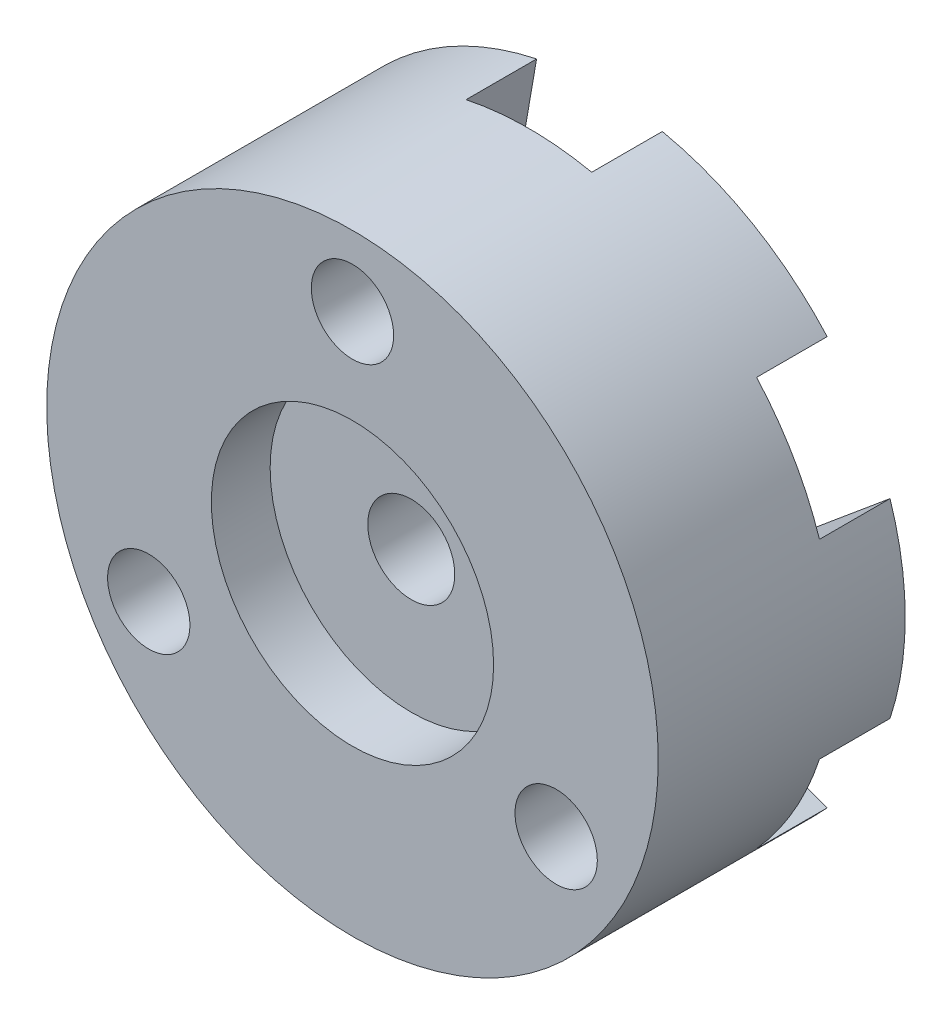
ISO-10303-21;
HEADER;
FILE_DESCRIPTION(('STEP AP214'),'2;1');
FILE_NAME('part.step','',(''),(''),'','','');
FILE_SCHEMA(('AUTOMOTIVE_DESIGN { 1 0 10303 214 1 1 1 1 }'));
ENDSEC;
DATA;
#1=APPLICATION_CONTEXT('core data for automotive mechanical design processes');
#2=APPLICATION_PROTOCOL_DEFINITION('international standard','automotive_design',2000,#1);
#3=PRODUCT_CONTEXT('',#1,'mechanical');
#4=PRODUCT('Part','Part','',(#3));
#5=PRODUCT_RELATED_PRODUCT_CATEGORY('part','',(#4));
#6=PRODUCT_DEFINITION_FORMATION('','',#4);
#7=PRODUCT_DEFINITION_CONTEXT('part definition',#1,'design');
#8=PRODUCT_DEFINITION('design','',#6,#7);
#9=PRODUCT_DEFINITION_SHAPE('','',#8);
#10=(LENGTH_UNIT() NAMED_UNIT(*) SI_UNIT(.MILLI.,.METRE.));
#11=(NAMED_UNIT(*) PLANE_ANGLE_UNIT() SI_UNIT($,.RADIAN.));
#12=(NAMED_UNIT(*) SI_UNIT($,.STERADIAN.) SOLID_ANGLE_UNIT());
#13=UNCERTAINTY_MEASURE_WITH_UNIT(LENGTH_MEASURE(1.E-05),#10,'distance_accuracy_value','');
#14=(GEOMETRIC_REPRESENTATION_CONTEXT(3) GLOBAL_UNCERTAINTY_ASSIGNED_CONTEXT((#13)) GLOBAL_UNIT_ASSIGNED_CONTEXT((#10,
#11,#12)) REPRESENTATION_CONTEXT('',''));
#15=CARTESIAN_POINT('',(0.,0.,0.));
#16=DIRECTION('',(0.,0.,1.));
#17=DIRECTION('',(1.,0.,0.));
#18=AXIS2_PLACEMENT_3D('',#15,#16,#17);
#19=CARTESIAN_POINT('',(0.,0.,0.));
#20=DIRECTION('',(0.,0.,1.));
#21=DIRECTION('',(1.,0.,0.));
#22=AXIS2_PLACEMENT_3D('',#19,#20,#21);
#23=CYLINDRICAL_SURFACE('',#22,6.);
#24=CARTESIAN_POINT('',(0.,0.,7.5));
#25=DIRECTION('',(0.,0.,1.));
#26=DIRECTION('',(1.,0.,0.));
#27=AXIS2_PLACEMENT_3D('',#24,#25,#26);
#28=CIRCLE('',#27,6.);
#29=CARTESIAN_POINT('',(6.,0.,7.5));
#30=VERTEX_POINT('',#29);
#31=EDGE_CURVE('E226',#30,#30,#28,.T.);
#32=ORIENTED_EDGE('',*,*,#31,.T.);
#33=EDGE_LOOP('',(#32));
#34=FACE_BOUND('',#33,.T.);
#35=CARTESIAN_POINT('',(0.,0.,5.));
#36=DIRECTION('',(0.,0.,-1.));
#37=DIRECTION('',(-1.,0.,0.));
#38=AXIS2_PLACEMENT_3D('',#35,#36,#37);
#39=CIRCLE('',#38,6.);
#40=CARTESIAN_POINT('',(-6.,0.,5.));
#41=VERTEX_POINT('',#40);
#42=EDGE_CURVE('E11',#41,#41,#39,.F.);
#43=ORIENTED_EDGE('',*,*,#42,.F.);
#44=EDGE_LOOP('',(#43));
#45=FACE_BOUND('',#44,.T.);
#46=ADVANCED_FACE('F33',(#34,#45),#23,.F.);
#47=CARTESIAN_POINT('',(0.,0.,-3.));
#48=DIRECTION('',(0.,0.,-1.));
#49=DIRECTION('',(-1.,0.,0.));
#50=AXIS2_PLACEMENT_3D('',#47,#48,#49);
#51=PLANE('',#50);
#52=DIRECTION('',(-0.170600768557539,0.985340234521851,0.));
#53=VECTOR('',#52,1.);
#54=CARTESIAN_POINT('',(3.75,6.49519052838327,-3.));
#55=LINE('',#54,#53);
#56=CARTESIAN_POINT('',(3.75,6.49519052838327,-3.));
#57=VERTEX_POINT('',#56);
#58=CARTESIAN_POINT('',(2.67181427614945,12.7224765071021,-3.));
#59=VERTEX_POINT('',#58);
#60=EDGE_CURVE('E668',#57,#59,#55,.T.);
#61=ORIENTED_EDGE('',*,*,#60,.T.);
#62=CARTESIAN_POINT('',(0.,0.,-3.));
#63=DIRECTION('',(0.,0.,-1.));
#64=DIRECTION('',(-1.,0.,0.));
#65=AXIS2_PLACEMENT_3D('',#62,#63,#64);
#66=CIRCLE('',#65,13.);
#67=CARTESIAN_POINT('',(9.68208071612639,8.67509729089038,-3.));
#68=VERTEX_POINT('',#67);
#69=EDGE_CURVE('E624',#59,#68,#66,.T.);
#70=ORIENTED_EDGE('',*,*,#69,.T.);
#71=DIRECTION('',(0.938630058745609,0.344925517784948,0.));
#72=VECTOR('',#71,1.);
#73=CARTESIAN_POINT('',(-1.65671533325682,4.50834377394232,-3.));
#74=LINE('',#73,#72);
#75=EDGE_CURVE('E41',#57,#68,#74,.T.);
#76=ORIENTED_EDGE('',*,*,#75,.F.);
#77=EDGE_LOOP('',(#61,#70,#76));
#78=FACE_BOUND('',#77,.T.);
#79=ADVANCED_FACE('F276',(#78),#51,.T.);
#80=DIRECTION('',(0.76802929018807,0.640414716736904,0.));
#81=VECTOR('',#80,1.);
#82=CARTESIAN_POINT('',(7.5,0.,-3.));
#83=LINE('',#82,#81);
#84=CARTESIAN_POINT('',(7.5,0.,-3.));
#85=VERTEX_POINT('',#84);
#86=CARTESIAN_POINT('',(12.3538949922758,4.04737921621166,-3.));
#87=VERTEX_POINT('',#86);
#88=EDGE_CURVE('E665',#85,#87,#83,.T.);
#89=ORIENTED_EDGE('',*,*,#88,.T.);
#90=CARTESIAN_POINT('',(12.3538949922758,-4.04737921621169,-3.));
#91=VERTEX_POINT('',#90);
#92=EDGE_CURVE('E619',#87,#91,#66,.T.);
#93=ORIENTED_EDGE('',*,*,#92,.T.);
#94=DIRECTION('',(0.768029290188071,-0.640414716736904,0.));
#95=VECTOR('',#94,1.);
#96=CARTESIAN_POINT('',(3.07598257059905,3.68892945241078,-3.));
#97=LINE('',#96,#95);
#98=EDGE_CURVE('E196',#85,#91,#97,.T.);
#99=ORIENTED_EDGE('',*,*,#98,.F.);
#100=EDGE_LOOP('',(#89,#93,#99));
#101=FACE_BOUND('',#100,.T.);
#102=ADVANCED_FACE('F282',(#101),#51,.T.);
#103=DIRECTION('',(0.938630058745609,-0.344925517784947,0.));
#104=VECTOR('',#103,1.);
#105=CARTESIAN_POINT('',(3.75,-6.49519052838331,-3.));
#106=LINE('',#105,#104);
#107=CARTESIAN_POINT('',(3.75,-6.49519052838331,-3.));
#108=VERTEX_POINT('',#107);
#109=CARTESIAN_POINT('',(9.68208071612636,-8.67509729089041,-3.));
#110=VERTEX_POINT('',#109);
#111=EDGE_CURVE('E608',#108,#110,#106,.T.);
#112=ORIENTED_EDGE('',*,*,#111,.T.);
#113=CARTESIAN_POINT('',(2.67181427614946,-12.7224765071021,-3.));
#114=VERTEX_POINT('',#113);
#115=EDGE_CURVE('E617',#110,#114,#66,.T.);
#116=ORIENTED_EDGE('',*,*,#115,.T.);
#117=DIRECTION('',(-0.170600768557539,-0.985340234521851,0.));
#118=VECTOR('',#117,1.);
#119=CARTESIAN_POINT('',(4.7326979038559,-0.819414321531559,-3.));
#120=LINE('',#119,#118);
#121=EDGE_CURVE('E189',#108,#114,#120,.T.);
#122=ORIENTED_EDGE('',*,*,#121,.F.);
#123=EDGE_LOOP('',(#112,#116,#122));
#124=FACE_BOUND('',#123,.T.);
#125=ADVANCED_FACE('F530',(#124),#51,.T.);
#126=DIRECTION('',(0.170600768557539,-0.985340234521851,0.));
#127=VECTOR('',#126,1.);
#128=CARTESIAN_POINT('',(-3.75,-6.49519052838332,-3.));
#129=LINE('',#128,#127);
#130=CARTESIAN_POINT('',(-3.75,-6.49519052838332,-3.));
#131=VERTEX_POINT('',#130);
#132=CARTESIAN_POINT('',(-2.67181427614946,-12.7224765071021,-3.));
#133=VERTEX_POINT('',#132);
#134=EDGE_CURVE('E182',#131,#133,#129,.T.);
#135=ORIENTED_EDGE('',*,*,#134,.T.);
#136=CARTESIAN_POINT('',(-9.68208071612636,-8.67509729089042,-3.));
#137=VERTEX_POINT('',#136);
#138=EDGE_CURVE('E224',#133,#137,#66,.T.);
#139=ORIENTED_EDGE('',*,*,#138,.T.);
#140=DIRECTION('',(-0.938630058745609,-0.344925517784948,0.));
#141=VECTOR('',#140,1.);
#142=CARTESIAN_POINT('',(1.65671533325684,-4.50834377394236,-3.));
#143=LINE('',#142,#141);
#144=EDGE_CURVE('E186',#131,#137,#143,.T.);
#145=ORIENTED_EDGE('',*,*,#144,.F.);
#146=EDGE_LOOP('',(#135,#139,#145));
#147=FACE_BOUND('',#146,.T.);
#148=ADVANCED_FACE('F272',(#147),#51,.T.);
#149=DIRECTION('',(-0.76802929018807,-0.640414716736904,0.));
#150=VECTOR('',#149,1.);
#151=CARTESIAN_POINT('',(-7.5,0.,-3.));
#152=LINE('',#151,#150);
#153=CARTESIAN_POINT('',(-7.5,0.,-3.));
#154=VERTEX_POINT('',#153);
#155=CARTESIAN_POINT('',(-12.3538949922758,-4.0473792162117,-3.));
#156=VERTEX_POINT('',#155);
#157=EDGE_CURVE('E175',#154,#156,#152,.T.);
#158=ORIENTED_EDGE('',*,*,#157,.T.);
#159=CARTESIAN_POINT('',(-12.3538949922758,4.04737921621165,-3.));
#160=VERTEX_POINT('',#159);
#161=EDGE_CURVE('E185',#156,#160,#66,.T.);
#162=ORIENTED_EDGE('',*,*,#161,.T.);
#163=DIRECTION('',(-0.768029290188071,0.640414716736903,0.));
#164=VECTOR('',#163,1.);
#165=CARTESIAN_POINT('',(-3.07598257059907,-3.6889294524108,-3.));
#166=LINE('',#165,#164);
#167=EDGE_CURVE('E164',#154,#160,#166,.T.);
#168=ORIENTED_EDGE('',*,*,#167,.F.);
#169=EDGE_LOOP('',(#158,#162,#168));
#170=FACE_BOUND('',#169,.T.);
#171=ADVANCED_FACE('F184',(#170),#51,.T.);
#172=CARTESIAN_POINT('',(-8.66025403784439,-5.,0.));
#173=DIRECTION('',(0.,0.,1.));
#174=DIRECTION('',(1.,0.,0.));
#175=AXIS2_PLACEMENT_3D('',#172,#173,#174);
#176=CYLINDRICAL_SURFACE('',#175,1.75);
#177=CARTESIAN_POINT('',(-8.66025403784439,-5.,7.5));
#178=DIRECTION('',(0.,0.,1.));
#179=DIRECTION('',(1.,0.,0.));
#180=AXIS2_PLACEMENT_3D('',#177,#178,#179);
#181=CIRCLE('',#180,1.75);
#182=CARTESIAN_POINT('',(-6.91025403784439,-5.,7.5));
#183=VERTEX_POINT('',#182);
#184=EDGE_CURVE('E245',#183,#183,#181,.T.);
#185=ORIENTED_EDGE('',*,*,#184,.T.);
#186=EDGE_LOOP('',(#185));
#187=FACE_BOUND('',#186,.T.);
#188=CARTESIAN_POINT('',(-8.66025403784439,-5.,2.6));
#189=DIRECTION('',(0.,0.,-1.));
#190=DIRECTION('',(-1.,0.,0.));
#191=AXIS2_PLACEMENT_3D('',#188,#189,#190);
#192=CIRCLE('',#191,1.75);
#193=CARTESIAN_POINT('',(-10.4102540378444,-5.,2.6));
#194=VERTEX_POINT('',#193);
#195=EDGE_CURVE('E248',#194,#194,#192,.F.);
#196=ORIENTED_EDGE('',*,*,#195,.F.);
#197=EDGE_LOOP('',(#196));
#198=FACE_BOUND('',#197,.T.);
#199=ADVANCED_FACE('F260',(#187,#198),#176,.F.);
#200=CARTESIAN_POINT('',(8.66025403784439,-5.,0.));
#201=DIRECTION('',(0.,0.,1.));
#202=DIRECTION('',(1.,0.,0.));
#203=AXIS2_PLACEMENT_3D('',#200,#201,#202);
#204=CYLINDRICAL_SURFACE('',#203,1.75);
#205=CARTESIAN_POINT('',(8.66025403784439,-5.,7.5));
#206=DIRECTION('',(0.,0.,1.));
#207=DIRECTION('',(1.,0.,0.));
#208=AXIS2_PLACEMENT_3D('',#205,#206,#207);
#209=CIRCLE('',#208,1.75);
#210=CARTESIAN_POINT('',(10.4102540378444,-5.,7.5));
#211=VERTEX_POINT('',#210);
#212=EDGE_CURVE('E242',#211,#211,#209,.T.);
#213=ORIENTED_EDGE('',*,*,#212,.T.);
#214=EDGE_LOOP('',(#213));
#215=FACE_BOUND('',#214,.T.);
#216=CARTESIAN_POINT('',(8.66025403784439,-5.,2.6));
#217=DIRECTION('',(0.,0.,-1.));
#218=DIRECTION('',(-1.,0.,0.));
#219=AXIS2_PLACEMENT_3D('',#216,#217,#218);
#220=CIRCLE('',#219,1.75);
#221=CARTESIAN_POINT('',(6.91025403784439,-5.,2.6));
#222=VERTEX_POINT('',#221);
#223=EDGE_CURVE('E253',#222,#222,#220,.F.);
#224=ORIENTED_EDGE('',*,*,#223,.F.);
#225=EDGE_LOOP('',(#224));
#226=FACE_BOUND('',#225,.T.);
#227=ADVANCED_FACE('F262',(#215,#226),#204,.F.);
#228=CARTESIAN_POINT('',(0.,10.,0.));
#229=DIRECTION('',(0.,0.,1.));
#230=DIRECTION('',(1.,0.,0.));
#231=AXIS2_PLACEMENT_3D('',#228,#229,#230);
#232=CYLINDRICAL_SURFACE('',#231,1.75);
#233=CARTESIAN_POINT('',(0.,10.,7.5));
#234=DIRECTION('',(0.,0.,1.));
#235=DIRECTION('',(1.,0.,0.));
#236=AXIS2_PLACEMENT_3D('',#233,#234,#235);
#237=CIRCLE('',#236,1.75);
#238=CARTESIAN_POINT('',(1.75,10.,7.5));
#239=VERTEX_POINT('',#238);
#240=EDGE_CURVE('E239',#239,#239,#237,.T.);
#241=ORIENTED_EDGE('',*,*,#240,.T.);
#242=EDGE_LOOP('',(#241));
#243=FACE_BOUND('',#242,.T.);
#244=CARTESIAN_POINT('',(0.,10.,2.6));
#245=DIRECTION('',(0.,0.,-1.));
#246=DIRECTION('',(-1.,0.,0.));
#247=AXIS2_PLACEMENT_3D('',#244,#245,#246);
#248=CIRCLE('',#247,1.75);
#249=CARTESIAN_POINT('',(-1.75,10.,2.6));
#250=VERTEX_POINT('',#249);
#251=EDGE_CURVE('E233',#250,#250,#248,.F.);
#252=ORIENTED_EDGE('',*,*,#251,.F.);
#253=EDGE_LOOP('',(#252));
#254=FACE_BOUND('',#253,.T.);
#255=ADVANCED_FACE('F269',(#243,#254),#232,.F.);
#256=CARTESIAN_POINT('',(0.,0.,7.5));
#257=DIRECTION('',(0.,0.,-1.));
#258=DIRECTION('',(-1.,0.,0.));
#259=AXIS2_PLACEMENT_3D('',#256,#257,#258);
#260=CYLINDRICAL_SURFACE('',#259,13.);
#261=CARTESIAN_POINT('',(0.,0.,0.));
#262=DIRECTION('',(0.,0.,1.));
#263=DIRECTION('',(1.,0.,0.));
#264=AXIS2_PLACEMENT_3D('',#261,#262,#263);
#265=CIRCLE('',#264,13.);
#266=CARTESIAN_POINT('',(12.3538949922758,4.04737921621166,0.));
#267=VERTEX_POINT('',#266);
#268=CARTESIAN_POINT('',(9.68208071612639,8.67509729089038,0.));
#269=VERTEX_POINT('',#268);
#270=EDGE_CURVE('E222',#267,#269,#265,.T.);
#271=ORIENTED_EDGE('',*,*,#270,.T.);
#272=DIRECTION('',(0.,0.,-1.));
#273=VECTOR('',#272,1.);
#274=CARTESIAN_POINT('',(9.68208071612639,8.67509729089037,7.5));
#275=LINE('',#274,#273);
#276=EDGE_CURVE('E206',#269,#68,#275,.T.);
#277=ORIENTED_EDGE('',*,*,#276,.T.);
#278=ORIENTED_EDGE('',*,*,#69,.F.);
#279=DIRECTION('',(0.,0.,-1.));
#280=VECTOR('',#279,1.);
#281=CARTESIAN_POINT('',(2.67181427614945,12.7224765071021,7.5));
#282=LINE('',#281,#280);
#283=CARTESIAN_POINT('',(2.67181427614945,12.7224765071021,0.));
#284=VERTEX_POINT('',#283);
#285=EDGE_CURVE('E56',#59,#284,#282,.F.);
#286=ORIENTED_EDGE('',*,*,#285,.T.);
#287=CARTESIAN_POINT('',(-2.67181427614945,12.7224765071021,0.));
#288=VERTEX_POINT('',#287);
#289=EDGE_CURVE('E638',#284,#288,#265,.T.);
#290=ORIENTED_EDGE('',*,*,#289,.T.);
#291=DIRECTION('',(0.,0.,-1.));
#292=VECTOR('',#291,1.);
#293=CARTESIAN_POINT('',(-2.67181427614945,12.7224765071021,7.5));
#294=LINE('',#293,#292);
#295=CARTESIAN_POINT('',(-2.67181427614945,12.7224765071021,-3.));
#296=VERTEX_POINT('',#295);
#297=EDGE_CURVE('E637',#288,#296,#294,.T.);
#298=ORIENTED_EDGE('',*,*,#297,.T.);
#299=CARTESIAN_POINT('',(-9.6820807161264,8.67509729089037,-3.));
#300=VERTEX_POINT('',#299);
#301=EDGE_CURVE('E225',#300,#296,#66,.T.);
#302=ORIENTED_EDGE('',*,*,#301,.F.);
#303=DIRECTION('',(0.,0.,-1.));
#304=VECTOR('',#303,1.);
#305=CARTESIAN_POINT('',(-9.68208071612639,8.67509729089037,7.5));
#306=LINE('',#305,#304);
#307=CARTESIAN_POINT('',(-9.68208071612639,8.67509729089037,0.));
#308=VERTEX_POINT('',#307);
#309=EDGE_CURVE('E636',#300,#308,#306,.F.);
#310=ORIENTED_EDGE('',*,*,#309,.T.);
#311=CARTESIAN_POINT('',(-12.3538949922758,4.04737921621165,0.));
#312=VERTEX_POINT('',#311);
#313=EDGE_CURVE('E710',#308,#312,#265,.T.);
#314=ORIENTED_EDGE('',*,*,#313,.T.);
#315=DIRECTION('',(0.,0.,-1.));
#316=VECTOR('',#315,1.);
#317=CARTESIAN_POINT('',(-12.3538949922758,4.04737921621165,7.5));
#318=LINE('',#317,#316);
#319=EDGE_CURVE('E642',#312,#160,#318,.T.);
#320=ORIENTED_EDGE('',*,*,#319,.T.);
#321=ORIENTED_EDGE('',*,*,#161,.F.);
#322=DIRECTION('',(0.,0.,-1.));
#323=VECTOR('',#322,1.);
#324=CARTESIAN_POINT('',(-12.3538949922758,-4.0473792162117,7.5));
#325=LINE('',#324,#323);
#326=CARTESIAN_POINT('',(-12.3538949922758,-4.0473792162117,0.));
#327=VERTEX_POINT('',#326);
#328=EDGE_CURVE('E178',#156,#327,#325,.F.);
#329=ORIENTED_EDGE('',*,*,#328,.T.);
#330=CARTESIAN_POINT('',(-9.68208071612635,-8.67509729089042,0.));
#331=VERTEX_POINT('',#330);
#332=EDGE_CURVE('E709',#327,#331,#265,.T.);
#333=ORIENTED_EDGE('',*,*,#332,.T.);
#334=DIRECTION('',(0.,0.,-1.));
#335=VECTOR('',#334,1.);
#336=CARTESIAN_POINT('',(-9.68208071612635,-8.67509729089041,7.5));
#337=LINE('',#336,#335);
#338=EDGE_CURVE('E616',#331,#137,#337,.T.);
#339=ORIENTED_EDGE('',*,*,#338,.T.);
#340=ORIENTED_EDGE('',*,*,#138,.F.);
#341=DIRECTION('',(0.,0.,-1.));
#342=VECTOR('',#341,1.);
#343=CARTESIAN_POINT('',(-2.67181427614946,-12.7224765071021,7.5));
#344=LINE('',#343,#342);
#345=CARTESIAN_POINT('',(-2.67181427614946,-12.7224765071021,0.));
#346=VERTEX_POINT('',#345);
#347=EDGE_CURVE('E614',#133,#346,#344,.F.);
#348=ORIENTED_EDGE('',*,*,#347,.T.);
#349=CARTESIAN_POINT('',(2.67181427614946,-12.7224765071021,0.));
#350=VERTEX_POINT('',#349);
#351=EDGE_CURVE('E221',#346,#350,#265,.T.);
#352=ORIENTED_EDGE('',*,*,#351,.T.);
#353=DIRECTION('',(0.,0.,-1.));
#354=VECTOR('',#353,1.);
#355=CARTESIAN_POINT('',(2.67181427614946,-12.7224765071021,7.5));
#356=LINE('',#355,#354);
#357=EDGE_CURVE('E653',#350,#114,#356,.T.);
#358=ORIENTED_EDGE('',*,*,#357,.T.);
#359=ORIENTED_EDGE('',*,*,#115,.F.);
#360=DIRECTION('',(0.,0.,-1.));
#361=VECTOR('',#360,1.);
#362=CARTESIAN_POINT('',(9.68208071612636,-8.67509729089041,7.5));
#363=LINE('',#362,#361);
#364=CARTESIAN_POINT('',(9.68208071612636,-8.67509729089041,0.));
#365=VERTEX_POINT('',#364);
#366=EDGE_CURVE('E656',#110,#365,#363,.F.);
#367=ORIENTED_EDGE('',*,*,#366,.T.);
#368=CARTESIAN_POINT('',(12.3538949922758,-4.04737921621169,0.));
#369=VERTEX_POINT('',#368);
#370=EDGE_CURVE('E218',#365,#369,#265,.T.);
#371=ORIENTED_EDGE('',*,*,#370,.T.);
#372=DIRECTION('',(0.,0.,-1.));
#373=VECTOR('',#372,1.);
#374=CARTESIAN_POINT('',(12.3538949922758,-4.04737921621169,7.5));
#375=LINE('',#374,#373);
#376=EDGE_CURVE('E659',#369,#91,#375,.T.);
#377=ORIENTED_EDGE('',*,*,#376,.T.);
#378=ORIENTED_EDGE('',*,*,#92,.F.);
#379=DIRECTION('',(0.,0.,-1.));
#380=VECTOR('',#379,1.);
#381=CARTESIAN_POINT('',(12.3538949922758,4.04737921621166,7.5));
#382=LINE('',#381,#380);
#383=EDGE_CURVE('E212',#87,#267,#382,.F.);
#384=ORIENTED_EDGE('',*,*,#383,.T.);
#385=EDGE_LOOP('',(#271,#277,#278,#286,#290,#298,#302,#310,#314,#320,#321,#329,#333,#339,#340,
#348,#352,#358,#359,#367,#371,#377,#378,#384));
#386=FACE_BOUND('',#385,.T.);
#387=CARTESIAN_POINT('',(0.,0.,7.5));
#388=DIRECTION('',(0.,0.,1.));
#389=DIRECTION('',(1.,0.,0.));
#390=AXIS2_PLACEMENT_3D('',#387,#388,#389);
#391=CIRCLE('',#390,13.);
#392=CARTESIAN_POINT('',(13.,0.,7.5));
#393=VERTEX_POINT('',#392);
#394=EDGE_CURVE('E191',#393,#393,#391,.T.);
#395=ORIENTED_EDGE('',*,*,#394,.F.);
#396=EDGE_LOOP('',(#395));
#397=FACE_BOUND('',#396,.T.);
#398=ADVANCED_FACE('F35',(#386,#397),#260,.T.);
#399=CARTESIAN_POINT('',(0.,0.,7.5));
#400=DIRECTION('',(0.,0.,1.));
#401=DIRECTION('',(1.,0.,0.));
#402=AXIS2_PLACEMENT_3D('',#399,#400,#401);
#403=PLANE('',#402);
#404=ORIENTED_EDGE('',*,*,#31,.F.);
#405=EDGE_LOOP('',(#404));
#406=FACE_BOUND('',#405,.T.);
#407=ORIENTED_EDGE('',*,*,#240,.F.);
#408=EDGE_LOOP('',(#407));
#409=FACE_BOUND('',#408,.T.);
#410=ORIENTED_EDGE('',*,*,#212,.F.);
#411=EDGE_LOOP('',(#410));
#412=FACE_BOUND('',#411,.T.);
#413=ORIENTED_EDGE('',*,*,#184,.F.);
#414=EDGE_LOOP('',(#413));
#415=FACE_BOUND('',#414,.T.);
#416=ORIENTED_EDGE('',*,*,#394,.T.);
#417=EDGE_LOOP('',(#416));
#418=FACE_BOUND('',#417,.T.);
#419=ADVANCED_FACE('F298',(#406,#409,#412,#415,#418),#403,.T.);
#420=CARTESIAN_POINT('',(0.,10.,2.6));
#421=DIRECTION('',(0.,0.,-1.));
#422=DIRECTION('',(-1.,0.,0.));
#423=AXIS2_PLACEMENT_3D('',#420,#421,#422);
#424=PLANE('',#423);
#425=CARTESIAN_POINT('',(0.,10.,2.6));
#426=DIRECTION('',(0.,0.,-1.));
#427=DIRECTION('',(-1.,0.,0.));
#428=AXIS2_PLACEMENT_3D('',#425,#426,#427);
#429=CIRCLE('',#428,2.8);
#430=CARTESIAN_POINT('',(-2.8,10.,2.6));
#431=VERTEX_POINT('',#430);
#432=EDGE_CURVE('E234',#431,#431,#429,.T.);
#433=ORIENTED_EDGE('',*,*,#432,.T.);
#434=EDGE_LOOP('',(#433));
#435=FACE_BOUND('',#434,.T.);
#436=ORIENTED_EDGE('',*,*,#251,.T.);
#437=EDGE_LOOP('',(#436));
#438=FACE_BOUND('',#437,.T.);
#439=ADVANCED_FACE('F294',(#435,#438),#424,.T.);
#440=CARTESIAN_POINT('',(0.,10.,2.6));
#441=DIRECTION('',(0.,0.,-1.));
#442=DIRECTION('',(-1.,0.,0.));
#443=AXIS2_PLACEMENT_3D('',#440,#441,#442);
#444=CYLINDRICAL_SURFACE('',#443,2.8);
#445=CARTESIAN_POINT('',(0.,10.,0.));
#446=DIRECTION('',(0.,0.,1.));
#447=DIRECTION('',(1.,0.,0.));
#448=AXIS2_PLACEMENT_3D('',#445,#446,#447);
#449=CIRCLE('',#448,2.8);
#450=CARTESIAN_POINT('',(2.8,10.,0.));
#451=VERTEX_POINT('',#450);
#452=EDGE_CURVE('E204',#451,#451,#449,.F.);
#453=ORIENTED_EDGE('',*,*,#452,.T.);
#454=EDGE_LOOP('',(#453));
#455=FACE_BOUND('',#454,.T.);
#456=ORIENTED_EDGE('',*,*,#432,.F.);
#457=EDGE_LOOP('',(#456));
#458=FACE_BOUND('',#457,.T.);
#459=ADVANCED_FACE('F297',(#455,#458),#444,.F.);
#460=CARTESIAN_POINT('',(8.66025403784439,-5.,2.6));
#461=DIRECTION('',(0.,0.,-1.));
#462=DIRECTION('',(-1.,0.,0.));
#463=AXIS2_PLACEMENT_3D('',#460,#461,#462);
#464=PLANE('',#463);
#465=CARTESIAN_POINT('',(8.66025403784439,-5.,2.6));
#466=DIRECTION('',(0.,0.,-1.));
#467=DIRECTION('',(-1.,0.,0.));
#468=AXIS2_PLACEMENT_3D('',#465,#466,#467);
#469=CIRCLE('',#468,2.8);
#470=CARTESIAN_POINT('',(5.86025403784439,-5.,2.6));
#471=VERTEX_POINT('',#470);
#472=EDGE_CURVE('E229',#471,#471,#469,.T.);
#473=ORIENTED_EDGE('',*,*,#472,.T.);
#474=EDGE_LOOP('',(#473));
#475=FACE_BOUND('',#474,.T.);
#476=ORIENTED_EDGE('',*,*,#223,.T.);
#477=EDGE_LOOP('',(#476));
#478=FACE_BOUND('',#477,.T.);
#479=ADVANCED_FACE('F302',(#475,#478),#464,.T.);
#480=CARTESIAN_POINT('',(8.66025403784439,-5.,2.6));
#481=DIRECTION('',(0.,0.,-1.));
#482=DIRECTION('',(-1.,0.,0.));
#483=AXIS2_PLACEMENT_3D('',#480,#481,#482);
#484=CYLINDRICAL_SURFACE('',#483,2.8);
#485=CARTESIAN_POINT('',(8.66025403784439,-5.,0.));
#486=DIRECTION('',(0.,0.,1.));
#487=DIRECTION('',(1.,0.,0.));
#488=AXIS2_PLACEMENT_3D('',#485,#486,#487);
#489=CIRCLE('',#488,2.8);
#490=CARTESIAN_POINT('',(11.4602540378444,-5.,0.));
#491=VERTEX_POINT('',#490);
#492=EDGE_CURVE('E200',#491,#491,#489,.F.);
#493=ORIENTED_EDGE('',*,*,#492,.T.);
#494=EDGE_LOOP('',(#493));
#495=FACE_BOUND('',#494,.T.);
#496=ORIENTED_EDGE('',*,*,#472,.F.);
#497=EDGE_LOOP('',(#496));
#498=FACE_BOUND('',#497,.T.);
#499=ADVANCED_FACE('F290',(#495,#498),#484,.F.);
#500=CARTESIAN_POINT('',(-8.66025403784439,-5.,2.6));
#501=DIRECTION('',(0.,0.,-1.));
#502=DIRECTION('',(-1.,0.,0.));
#503=AXIS2_PLACEMENT_3D('',#500,#501,#502);
#504=PLANE('',#503);
#505=CARTESIAN_POINT('',(-8.66025403784439,-5.,2.6));
#506=DIRECTION('',(0.,0.,-1.));
#507=DIRECTION('',(-1.,0.,0.));
#508=AXIS2_PLACEMENT_3D('',#505,#506,#507);
#509=CIRCLE('',#508,2.8);
#510=CARTESIAN_POINT('',(-11.4602540378444,-5.,2.6));
#511=VERTEX_POINT('',#510);
#512=EDGE_CURVE('E230',#511,#511,#509,.T.);
#513=ORIENTED_EDGE('',*,*,#512,.T.);
#514=EDGE_LOOP('',(#513));
#515=FACE_BOUND('',#514,.T.);
#516=ORIENTED_EDGE('',*,*,#195,.T.);
#517=EDGE_LOOP('',(#516));
#518=FACE_BOUND('',#517,.T.);
#519=ADVANCED_FACE('F258',(#515,#518),#504,.T.);
#520=CARTESIAN_POINT('',(-8.66025403784439,-5.,2.6));
#521=DIRECTION('',(0.,0.,-1.));
#522=DIRECTION('',(-1.,0.,0.));
#523=AXIS2_PLACEMENT_3D('',#520,#521,#522);
#524=CYLINDRICAL_SURFACE('',#523,2.8);
#525=CARTESIAN_POINT('',(-8.66025403784439,-5.,0.));
#526=DIRECTION('',(0.,0.,1.));
#527=DIRECTION('',(1.,0.,0.));
#528=AXIS2_PLACEMENT_3D('',#525,#526,#527);
#529=CIRCLE('',#528,2.8);
#530=CARTESIAN_POINT('',(-5.86025403784439,-5.,0.));
#531=VERTEX_POINT('',#530);
#532=EDGE_CURVE('E198',#531,#531,#529,.F.);
#533=ORIENTED_EDGE('',*,*,#532,.T.);
#534=EDGE_LOOP('',(#533));
#535=FACE_BOUND('',#534,.T.);
#536=ORIENTED_EDGE('',*,*,#512,.F.);
#537=EDGE_LOOP('',(#536));
#538=FACE_BOUND('',#537,.T.);
#539=ADVANCED_FACE('F289',(#535,#538),#524,.F.);
#540=DIRECTION('',(-0.93863005874561,0.344925517784946,0.));
#541=VECTOR('',#540,1.);
#542=CARTESIAN_POINT('',(-3.75,6.49519052838327,-3.));
#543=LINE('',#542,#541);
#544=CARTESIAN_POINT('',(-3.75,6.49519052838327,-3.));
#545=VERTEX_POINT('',#544);
#546=EDGE_CURVE('E48',#545,#300,#543,.T.);
#547=ORIENTED_EDGE('',*,*,#546,.T.);
#548=ORIENTED_EDGE('',*,*,#301,.T.);
#549=DIRECTION('',(0.170600768557539,0.985340234521851,0.));
#550=VECTOR('',#549,1.);
#551=CARTESIAN_POINT('',(-4.73269790385589,0.819414321531557,-3.));
#552=LINE('',#551,#550);
#553=EDGE_CURVE('E187',#545,#296,#552,.T.);
#554=ORIENTED_EDGE('',*,*,#553,.F.);
#555=EDGE_LOOP('',(#547,#548,#554));
#556=FACE_BOUND('',#555,.T.);
#557=ADVANCED_FACE('F274',(#556),#51,.T.);
#558=CARTESIAN_POINT('',(0.,13.5,0.));
#559=DIRECTION('',(0.,0.,1.));
#560=DIRECTION('',(1.,0.,0.));
#561=AXIS2_PLACEMENT_3D('',#558,#559,#560);
#562=PLANE('',#561);
#563=ORIENTED_EDGE('',*,*,#492,.F.);
#564=EDGE_LOOP('',(#563));
#565=FACE_BOUND('',#564,.T.);
#566=ORIENTED_EDGE('',*,*,#532,.F.);
#567=EDGE_LOOP('',(#566));
#568=FACE_BOUND('',#567,.T.);
#569=ORIENTED_EDGE('',*,*,#452,.F.);
#570=EDGE_LOOP('',(#569));
#571=FACE_BOUND('',#570,.T.);
#572=DIRECTION('',(0.76802929018807,0.640414716736904,0.));
#573=VECTOR('',#572,1.);
#574=CARTESIAN_POINT('',(7.5,0.,0.));
#575=LINE('',#574,#573);
#576=CARTESIAN_POINT('',(7.5,0.,0.));
#577=VERTEX_POINT('',#576);
#578=EDGE_CURVE('E667',#577,#267,#575,.T.);
#579=ORIENTED_EDGE('',*,*,#578,.F.);
#580=DIRECTION('',(-0.768029290188071,0.640414716736904,0.));
#581=VECTOR('',#580,1.);
#582=CARTESIAN_POINT('',(7.5,0.,0.));
#583=LINE('',#582,#581);
#584=EDGE_CURVE('E692',#369,#577,#583,.T.);
#585=ORIENTED_EDGE('',*,*,#584,.F.);
#586=ORIENTED_EDGE('',*,*,#370,.F.);
#587=DIRECTION('',(0.938630058745609,-0.344925517784947,0.));
#588=VECTOR('',#587,1.);
#589=CARTESIAN_POINT('',(3.75,-6.49519052838331,0.));
#590=LINE('',#589,#588);
#591=CARTESIAN_POINT('',(3.75,-6.49519052838331,0.));
#592=VERTEX_POINT('',#591);
#593=EDGE_CURVE('E689',#592,#365,#590,.T.);
#594=ORIENTED_EDGE('',*,*,#593,.F.);
#595=DIRECTION('',(0.170600768557539,0.985340234521851,0.));
#596=VECTOR('',#595,1.);
#597=CARTESIAN_POINT('',(3.75,-6.49519052838331,0.));
#598=LINE('',#597,#596);
#599=EDGE_CURVE('E687',#350,#592,#598,.T.);
#600=ORIENTED_EDGE('',*,*,#599,.F.);
#601=ORIENTED_EDGE('',*,*,#351,.F.);
#602=DIRECTION('',(0.170600768557539,-0.985340234521851,0.));
#603=VECTOR('',#602,1.);
#604=CARTESIAN_POINT('',(-3.75,-6.49519052838332,0.));
#605=LINE('',#604,#603);
#606=CARTESIAN_POINT('',(-3.75,-6.49519052838332,0.));
#607=VERTEX_POINT('',#606);
#608=EDGE_CURVE('E684',#607,#346,#605,.T.);
#609=ORIENTED_EDGE('',*,*,#608,.F.);
#610=DIRECTION('',(0.938630058745609,0.344925517784948,0.));
#611=VECTOR('',#610,1.);
#612=CARTESIAN_POINT('',(-3.75,-6.49519052838332,0.));
#613=LINE('',#612,#611);
#614=EDGE_CURVE('E682',#331,#607,#613,.T.);
#615=ORIENTED_EDGE('',*,*,#614,.F.);
#616=ORIENTED_EDGE('',*,*,#332,.F.);
#617=DIRECTION('',(-0.76802929018807,-0.640414716736904,0.));
#618=VECTOR('',#617,1.);
#619=CARTESIAN_POINT('',(-7.5,0.,0.));
#620=LINE('',#619,#618);
#621=CARTESIAN_POINT('',(-7.5,0.,0.));
#622=VERTEX_POINT('',#621);
#623=EDGE_CURVE('E680',#622,#327,#620,.T.);
#624=ORIENTED_EDGE('',*,*,#623,.F.);
#625=DIRECTION('',(0.768029290188071,-0.640414716736903,0.));
#626=VECTOR('',#625,1.);
#627=CARTESIAN_POINT('',(-7.5,0.,0.));
#628=LINE('',#627,#626);
#629=EDGE_CURVE('E167',#312,#622,#628,.T.);
#630=ORIENTED_EDGE('',*,*,#629,.F.);
#631=ORIENTED_EDGE('',*,*,#313,.F.);
#632=DIRECTION('',(-0.93863005874561,0.344925517784946,0.));
#633=VECTOR('',#632,1.);
#634=CARTESIAN_POINT('',(-3.75,6.49519052838327,0.));
#635=LINE('',#634,#633);
#636=CARTESIAN_POINT('',(-3.75,6.49519052838327,0.));
#637=VERTEX_POINT('',#636);
#638=EDGE_CURVE('E675',#637,#308,#635,.T.);
#639=ORIENTED_EDGE('',*,*,#638,.F.);
#640=DIRECTION('',(-0.170600768557539,-0.985340234521851,0.));
#641=VECTOR('',#640,1.);
#642=CARTESIAN_POINT('',(-3.75,6.49519052838327,0.));
#643=LINE('',#642,#641);
#644=EDGE_CURVE('E673',#288,#637,#643,.T.);
#645=ORIENTED_EDGE('',*,*,#644,.F.);
#646=ORIENTED_EDGE('',*,*,#289,.F.);
#647=DIRECTION('',(-0.170600768557539,0.985340234521851,0.));
#648=VECTOR('',#647,1.);
#649=CARTESIAN_POINT('',(3.75,6.49519052838327,0.));
#650=LINE('',#649,#648);
#651=CARTESIAN_POINT('',(3.75,6.49519052838327,0.));
#652=VERTEX_POINT('',#651);
#653=EDGE_CURVE('E697',#652,#284,#650,.T.);
#654=ORIENTED_EDGE('',*,*,#653,.F.);
#655=DIRECTION('',(-0.938630058745609,-0.344925517784948,0.));
#656=VECTOR('',#655,1.);
#657=CARTESIAN_POINT('',(3.75,6.49519052838327,0.));
#658=LINE('',#657,#656);
#659=EDGE_CURVE('E695',#269,#652,#658,.T.);
#660=ORIENTED_EDGE('',*,*,#659,.F.);
#661=ORIENTED_EDGE('',*,*,#270,.F.);
#662=EDGE_LOOP('',(#579,#585,#586,#594,#600,#601,#609,#615,#616,#624,#630,#631,#639,#645,#646,
#654,#660,#661));
#663=FACE_BOUND('',#662,.T.);
#664=CARTESIAN_POINT('',(0.,0.,0.));
#665=DIRECTION('',(0.,0.,-1.));
#666=DIRECTION('',(-1.,0.,0.));
#667=AXIS2_PLACEMENT_3D('',#664,#665,#666);
#668=CIRCLE('',#667,1.85);
#669=CARTESIAN_POINT('',(-1.85,0.,0.));
#670=VERTEX_POINT('',#669);
#671=EDGE_CURVE('E718',#670,#670,#668,.T.);
#672=ORIENTED_EDGE('',*,*,#671,.F.);
#673=EDGE_LOOP('',(#672));
#674=FACE_BOUND('',#673,.T.);
#675=ADVANCED_FACE('F368',(#565,#568,#571,#663,#674),#562,.F.);
#676=CARTESIAN_POINT('',(3.75,6.49519052838327,-3.));
#677=DIRECTION('',(0.985340234521851,0.170600768557539,0.));
#678=DIRECTION('',(-0.170600768557539,0.985340234521851,0.));
#679=AXIS2_PLACEMENT_3D('',#676,#677,#678);
#680=PLANE('',#679);
#681=ORIENTED_EDGE('',*,*,#60,.F.);
#682=DIRECTION('',(0.,0.,1.));
#683=VECTOR('',#682,1.);
#684=CARTESIAN_POINT('',(3.75,6.49519052838327,-3.));
#685=LINE('',#684,#683);
#686=EDGE_CURVE('E640',#57,#652,#685,.T.);
#687=ORIENTED_EDGE('',*,*,#686,.T.);
#688=ORIENTED_EDGE('',*,*,#653,.T.);
#689=ORIENTED_EDGE('',*,*,#285,.F.);
#690=EDGE_LOOP('',(#681,#687,#688,#689));
#691=FACE_BOUND('',#690,.T.);
#692=ADVANCED_FACE('F376',(#691),#680,.F.);
#693=CARTESIAN_POINT('',(3.75,6.49519052838327,-3.));
#694=DIRECTION('',(-0.344925517784948,0.938630058745609,0.));
#695=DIRECTION('',(-0.938630058745609,-0.344925517784948,0.));
#696=AXIS2_PLACEMENT_3D('',#693,#694,#695);
#697=PLANE('',#696);
#698=ORIENTED_EDGE('',*,*,#659,.T.);
#699=ORIENTED_EDGE('',*,*,#686,.F.);
#700=ORIENTED_EDGE('',*,*,#75,.T.);
#701=ORIENTED_EDGE('',*,*,#276,.F.);
#702=EDGE_LOOP('',(#698,#699,#700,#701));
#703=FACE_BOUND('',#702,.T.);
#704=ADVANCED_FACE('F384',(#703),#697,.F.);
#705=CARTESIAN_POINT('',(7.5,0.,-3.));
#706=DIRECTION('',(0.640414716736904,-0.76802929018807,0.));
#707=DIRECTION('',(0.76802929018807,0.640414716736904,0.));
#708=AXIS2_PLACEMENT_3D('',#705,#706,#707);
#709=PLANE('',#708);
#710=ORIENTED_EDGE('',*,*,#88,.F.);
#711=DIRECTION('',(0.,0.,1.));
#712=VECTOR('',#711,1.);
#713=CARTESIAN_POINT('',(7.5,0.,-3.));
#714=LINE('',#713,#712);
#715=EDGE_CURVE('E645',#85,#577,#714,.T.);
#716=ORIENTED_EDGE('',*,*,#715,.T.);
#717=ORIENTED_EDGE('',*,*,#578,.T.);
#718=ORIENTED_EDGE('',*,*,#383,.F.);
#719=EDGE_LOOP('',(#710,#716,#717,#718));
#720=FACE_BOUND('',#719,.T.);
#721=ADVANCED_FACE('F391',(#720),#709,.F.);
#722=CARTESIAN_POINT('',(7.5,0.,-3.));
#723=DIRECTION('',(0.640414716736904,0.768029290188071,0.));
#724=DIRECTION('',(-0.768029290188071,0.640414716736904,0.));
#725=AXIS2_PLACEMENT_3D('',#722,#723,#724);
#726=PLANE('',#725);
#727=ORIENTED_EDGE('',*,*,#584,.T.);
#728=ORIENTED_EDGE('',*,*,#715,.F.);
#729=ORIENTED_EDGE('',*,*,#98,.T.);
#730=ORIENTED_EDGE('',*,*,#376,.F.);
#731=EDGE_LOOP('',(#727,#728,#729,#730));
#732=FACE_BOUND('',#731,.T.);
#733=ADVANCED_FACE('F399',(#732),#726,.F.);
#734=CARTESIAN_POINT('',(3.75,-6.49519052838331,-3.));
#735=DIRECTION('',(-0.344925517784947,-0.938630058745609,0.));
#736=DIRECTION('',(0.938630058745609,-0.344925517784947,0.));
#737=AXIS2_PLACEMENT_3D('',#734,#735,#736);
#738=PLANE('',#737);
#739=ORIENTED_EDGE('',*,*,#111,.F.);
#740=DIRECTION('',(0.,0.,1.));
#741=VECTOR('',#740,1.);
#742=CARTESIAN_POINT('',(3.75,-6.49519052838331,-3.));
#743=LINE('',#742,#741);
#744=EDGE_CURVE('E700',#108,#592,#743,.T.);
#745=ORIENTED_EDGE('',*,*,#744,.T.);
#746=ORIENTED_EDGE('',*,*,#593,.T.);
#747=ORIENTED_EDGE('',*,*,#366,.F.);
#748=EDGE_LOOP('',(#739,#745,#746,#747));
#749=FACE_BOUND('',#748,.T.);
#750=ADVANCED_FACE('F407',(#749),#738,.F.);
#751=CARTESIAN_POINT('',(3.75,-6.49519052838331,-3.));
#752=DIRECTION('',(0.985340234521851,-0.170600768557539,0.));
#753=DIRECTION('',(0.170600768557539,0.985340234521851,0.));
#754=AXIS2_PLACEMENT_3D('',#751,#752,#753);
#755=PLANE('',#754);
#756=ORIENTED_EDGE('',*,*,#599,.T.);
#757=ORIENTED_EDGE('',*,*,#744,.F.);
#758=ORIENTED_EDGE('',*,*,#121,.T.);
#759=ORIENTED_EDGE('',*,*,#357,.F.);
#760=EDGE_LOOP('',(#756,#757,#758,#759));
#761=FACE_BOUND('',#760,.T.);
#762=ADVANCED_FACE('F415',(#761),#755,.F.);
#763=CARTESIAN_POINT('',(-3.75,-6.49519052838332,-3.));
#764=DIRECTION('',(-0.985340234521851,-0.170600768557539,0.));
#765=DIRECTION('',(0.170600768557539,-0.985340234521851,0.));
#766=AXIS2_PLACEMENT_3D('',#763,#764,#765);
#767=PLANE('',#766);
#768=ORIENTED_EDGE('',*,*,#134,.F.);
#769=DIRECTION('',(0.,0.,1.));
#770=VECTOR('',#769,1.);
#771=CARTESIAN_POINT('',(-3.75,-6.49519052838332,-3.));
#772=LINE('',#771,#770);
#773=EDGE_CURVE('E171',#131,#607,#772,.T.);
#774=ORIENTED_EDGE('',*,*,#773,.T.);
#775=ORIENTED_EDGE('',*,*,#608,.T.);
#776=ORIENTED_EDGE('',*,*,#347,.F.);
#777=EDGE_LOOP('',(#768,#774,#775,#776));
#778=FACE_BOUND('',#777,.T.);
#779=ADVANCED_FACE('F423',(#778),#767,.F.);
#780=CARTESIAN_POINT('',(-3.75,-6.49519052838332,-3.));
#781=DIRECTION('',(0.344925517784948,-0.938630058745609,0.));
#782=DIRECTION('',(0.938630058745609,0.344925517784948,0.));
#783=AXIS2_PLACEMENT_3D('',#780,#781,#782);
#784=PLANE('',#783);
#785=ORIENTED_EDGE('',*,*,#614,.T.);
#786=ORIENTED_EDGE('',*,*,#773,.F.);
#787=ORIENTED_EDGE('',*,*,#144,.T.);
#788=ORIENTED_EDGE('',*,*,#338,.F.);
#789=EDGE_LOOP('',(#785,#786,#787,#788));
#790=FACE_BOUND('',#789,.T.);
#791=ADVANCED_FACE('F431',(#790),#784,.F.);
#792=CARTESIAN_POINT('',(-7.5,0.,-3.));
#793=DIRECTION('',(-0.640414716736904,0.76802929018807,0.));
#794=DIRECTION('',(-0.76802929018807,-0.640414716736904,0.));
#795=AXIS2_PLACEMENT_3D('',#792,#793,#794);
#796=PLANE('',#795);
#797=ORIENTED_EDGE('',*,*,#157,.F.);
#798=DIRECTION('',(0.,0.,1.));
#799=VECTOR('',#798,1.);
#800=CARTESIAN_POINT('',(-7.5,0.,-3.));
#801=LINE('',#800,#799);
#802=EDGE_CURVE('E160',#154,#622,#801,.T.);
#803=ORIENTED_EDGE('',*,*,#802,.T.);
#804=ORIENTED_EDGE('',*,*,#623,.T.);
#805=ORIENTED_EDGE('',*,*,#328,.F.);
#806=EDGE_LOOP('',(#797,#803,#804,#805));
#807=FACE_BOUND('',#806,.T.);
#808=ADVANCED_FACE('F176',(#807),#796,.F.);
#809=CARTESIAN_POINT('',(-7.5,0.,-3.));
#810=DIRECTION('',(-0.640414716736903,-0.768029290188071,0.));
#811=DIRECTION('',(0.768029290188071,-0.640414716736903,0.));
#812=AXIS2_PLACEMENT_3D('',#809,#810,#811);
#813=PLANE('',#812);
#814=ORIENTED_EDGE('',*,*,#629,.T.);
#815=ORIENTED_EDGE('',*,*,#802,.F.);
#816=ORIENTED_EDGE('',*,*,#167,.T.);
#817=ORIENTED_EDGE('',*,*,#319,.F.);
#818=EDGE_LOOP('',(#814,#815,#816,#817));
#819=FACE_BOUND('',#818,.T.);
#820=ADVANCED_FACE('F162',(#819),#813,.F.);
#821=CARTESIAN_POINT('',(-3.75,6.49519052838327,-3.));
#822=DIRECTION('',(0.344925517784946,0.93863005874561,0.));
#823=DIRECTION('',(-0.93863005874561,0.344925517784946,0.));
#824=AXIS2_PLACEMENT_3D('',#821,#822,#823);
#825=PLANE('',#824);
#826=ORIENTED_EDGE('',*,*,#546,.F.);
#827=DIRECTION('',(0.,0.,1.));
#828=VECTOR('',#827,1.);
#829=CARTESIAN_POINT('',(-3.75,6.49519052838327,-3.));
#830=LINE('',#829,#828);
#831=EDGE_CURVE('E172',#545,#637,#830,.T.);
#832=ORIENTED_EDGE('',*,*,#831,.T.);
#833=ORIENTED_EDGE('',*,*,#638,.T.);
#834=ORIENTED_EDGE('',*,*,#309,.F.);
#835=EDGE_LOOP('',(#826,#832,#833,#834));
#836=FACE_BOUND('',#835,.T.);
#837=ADVANCED_FACE('F452',(#836),#825,.F.);
#838=CARTESIAN_POINT('',(-3.75,6.49519052838327,-3.));
#839=DIRECTION('',(-0.985340234521851,0.170600768557539,0.));
#840=DIRECTION('',(-0.170600768557539,-0.985340234521851,0.));
#841=AXIS2_PLACEMENT_3D('',#838,#839,#840);
#842=PLANE('',#841);
#843=ORIENTED_EDGE('',*,*,#644,.T.);
#844=ORIENTED_EDGE('',*,*,#831,.F.);
#845=ORIENTED_EDGE('',*,*,#553,.T.);
#846=ORIENTED_EDGE('',*,*,#297,.F.);
#847=EDGE_LOOP('',(#843,#844,#845,#846));
#848=FACE_BOUND('',#847,.T.);
#849=ADVANCED_FACE('F459',(#848),#842,.F.);
#850=CARTESIAN_POINT('',(0.,0.,5.));
#851=DIRECTION('',(0.,0.,-1.));
#852=DIRECTION('',(-1.,0.,0.));
#853=AXIS2_PLACEMENT_3D('',#850,#851,#852);
#854=PLANE('',#853);
#855=CARTESIAN_POINT('',(0.,0.,5.));
#856=DIRECTION('',(0.,0.,-1.));
#857=DIRECTION('',(-1.,0.,0.));
#858=AXIS2_PLACEMENT_3D('',#855,#856,#857);
#859=CIRCLE('',#858,1.85);
#860=CARTESIAN_POINT('',(-1.85,0.,5.));
#861=VERTEX_POINT('',#860);
#862=EDGE_CURVE('E676',#861,#861,#859,.T.);
#863=ORIENTED_EDGE('',*,*,#862,.T.);
#864=EDGE_LOOP('',(#863));
#865=FACE_BOUND('',#864,.T.);
#866=ORIENTED_EDGE('',*,*,#42,.T.);
#867=EDGE_LOOP('',(#866));
#868=FACE_BOUND('',#867,.T.);
#869=ADVANCED_FACE('F466',(#865,#868),#854,.F.);
#870=CARTESIAN_POINT('',(0.,0.,5.));
#871=DIRECTION('',(0.,0.,-1.));
#872=DIRECTION('',(-1.,0.,0.));
#873=AXIS2_PLACEMENT_3D('',#870,#871,#872);
#874=CYLINDRICAL_SURFACE('',#873,1.85);
#875=ORIENTED_EDGE('',*,*,#862,.F.);
#876=EDGE_LOOP('',(#875));
#877=FACE_BOUND('',#876,.T.);
#878=ORIENTED_EDGE('',*,*,#671,.T.);
#879=EDGE_LOOP('',(#878));
#880=FACE_BOUND('',#879,.T.);
#881=ADVANCED_FACE('F472',(#877,#880),#874,.F.);
#882=CLOSED_SHELL('',(#46,#79,#102,#125,#148,#171,#199,#227,#255,#398,#419,#439,#459,#479,#499,
#519,#539,#557,#675,#692,#704,#721,#733,#750,#762,#779,#791,#808,#820,#837,#849,#869,#881));
#883=MANIFOLD_SOLID_BREP('B2',#882);
#884=ADVANCED_BREP_SHAPE_REPRESENTATION('',(#18,#883),#14);
#885=SHAPE_DEFINITION_REPRESENTATION(#9,#884);
ENDSEC;
END-ISO-10303-21;
